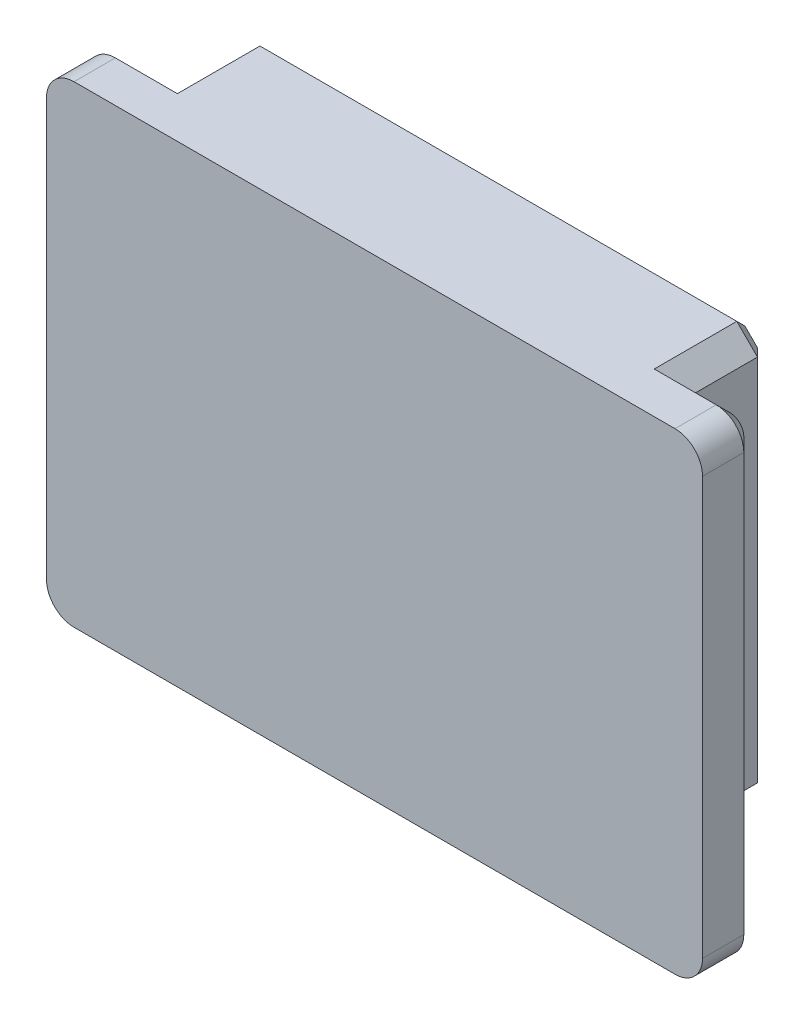
ISO-10303-21;
HEADER;
FILE_DESCRIPTION(('STEP AP214'),'2;1');
FILE_NAME('part.step','',(''),(''),'','','');
FILE_SCHEMA(('AUTOMOTIVE_DESIGN { 1 0 10303 214 1 1 1 1 }'));
ENDSEC;
DATA;
#1=APPLICATION_CONTEXT('core data for automotive mechanical design processes');
#2=APPLICATION_PROTOCOL_DEFINITION('international standard','automotive_design',2000,#1);
#3=PRODUCT_CONTEXT('',#1,'mechanical');
#4=PRODUCT('Part','Part','',(#3));
#5=PRODUCT_RELATED_PRODUCT_CATEGORY('part','',(#4));
#6=PRODUCT_DEFINITION_FORMATION('','',#4);
#7=PRODUCT_DEFINITION_CONTEXT('part definition',#1,'design');
#8=PRODUCT_DEFINITION('design','',#6,#7);
#9=PRODUCT_DEFINITION_SHAPE('','',#8);
#10=(LENGTH_UNIT() NAMED_UNIT(*) SI_UNIT(.MILLI.,.METRE.));
#11=(NAMED_UNIT(*) PLANE_ANGLE_UNIT() SI_UNIT($,.RADIAN.));
#12=(NAMED_UNIT(*) SI_UNIT($,.STERADIAN.) SOLID_ANGLE_UNIT());
#13=UNCERTAINTY_MEASURE_WITH_UNIT(LENGTH_MEASURE(1.E-05),#10,'distance_accuracy_value','');
#14=(GEOMETRIC_REPRESENTATION_CONTEXT(3) GLOBAL_UNCERTAINTY_ASSIGNED_CONTEXT((#13)) GLOBAL_UNIT_ASSIGNED_CONTEXT((#10,
#11,#12)) REPRESENTATION_CONTEXT('',''));
#15=CARTESIAN_POINT('',(0.,0.,0.));
#16=DIRECTION('',(0.,0.,1.));
#17=DIRECTION('',(1.,0.,0.));
#18=AXIS2_PLACEMENT_3D('',#15,#16,#17);
#19=CARTESIAN_POINT('',(0.,0.,0.));
#20=DIRECTION('',(0.,0.,1.));
#21=DIRECTION('',(1.,0.,0.));
#22=AXIS2_PLACEMENT_3D('',#19,#20,#21);
#23=PLANE('',#22);
#24=CARTESIAN_POINT('',(2.,32.3333333333333,0.));
#25=DIRECTION('',(0.,0.,1.));
#26=DIRECTION('',(1.,0.,0.));
#27=AXIS2_PLACEMENT_3D('',#24,#25,#26);
#28=CIRCLE('',#27,1.);
#29=CARTESIAN_POINT('',(1.,32.3333333333333,0.));
#30=VERTEX_POINT('',#29);
#31=CARTESIAN_POINT('',(2.,33.3333333333333,0.));
#32=VERTEX_POINT('',#31);
#33=EDGE_CURVE('E410',#30,#32,#28,.F.);
#34=ORIENTED_EDGE('',*,*,#33,.T.);
#35=DIRECTION('',(1.,0.,0.));
#36=VECTOR('',#35,1.);
#37=CARTESIAN_POINT('',(6.50757636642431,33.3333333333333,0.));
#38=LINE('',#37,#36);
#39=CARTESIAN_POINT('',(5.50757636642431,33.3333333333333,0.));
#40=VERTEX_POINT('',#39);
#41=EDGE_CURVE('E413',#32,#40,#38,.T.);
#42=ORIENTED_EDGE('',*,*,#41,.T.);
#43=DIRECTION('',(0.707106781186546,0.707106781186549,0.));
#44=VECTOR('',#43,1.);
#45=CARTESIAN_POINT('',(-13.9128784834545,13.9128784834544,0.));
#46=LINE('',#45,#44);
#47=CARTESIAN_POINT('',(5.00757636642431,32.8333333333333,0.));
#48=VERTEX_POINT('',#47);
#49=EDGE_CURVE('E295',#40,#48,#46,.F.);
#50=ORIENTED_EDGE('',*,*,#49,.T.);
#51=DIRECTION('',(0.,-1.,0.));
#52=VECTOR('',#51,1.);
#53=CARTESIAN_POINT('',(5.00757636642431,0.,0.));
#54=LINE('',#53,#52);
#55=CARTESIAN_POINT('',(5.00757636642431,6.03695282809008,0.));
#56=VERTEX_POINT('',#55);
#57=EDGE_CURVE('E510',#48,#56,#54,.T.);
#58=ORIENTED_EDGE('',*,*,#57,.T.);
#59=DIRECTION('',(-0.707106781186549,0.707106781186546,0.));
#60=VECTOR('',#59,1.);
#61=CARTESIAN_POINT('',(5.52226459725718,5.52226459725721,0.));
#62=LINE('',#61,#60);
#63=CARTESIAN_POINT('',(6.50757636642432,4.53695282809008,0.));
#64=VERTEX_POINT('',#63);
#65=EDGE_CURVE('E305',#56,#64,#62,.F.);
#66=ORIENTED_EDGE('',*,*,#65,.T.);
#67=DIRECTION('',(1.,0.,0.));
#68=VECTOR('',#67,1.);
#69=CARTESIAN_POINT('',(0.,4.53695282809008,0.));
#70=LINE('',#69,#68);
#71=CARTESIAN_POINT('',(41.1590903002424,4.53695282809008,0.));
#72=VERTEX_POINT('',#71);
#73=EDGE_CURVE('E506',#64,#72,#70,.T.);
#74=ORIENTED_EDGE('',*,*,#73,.T.);
#75=DIRECTION('',(0.707106781186544,0.707106781186551,0.));
#76=VECTOR('',#75,1.);
#77=CARTESIAN_POINT('',(18.3110687360763,-18.3110687360762,0.));
#78=LINE('',#77,#76);
#79=CARTESIAN_POINT('',(42.6590903002424,6.03695282809008,0.));
#80=VERTEX_POINT('',#79);
#81=EDGE_CURVE('E302',#72,#80,#78,.T.);
#82=ORIENTED_EDGE('',*,*,#81,.T.);
#83=DIRECTION('',(0.,-1.,0.));
#84=VECTOR('',#83,1.);
#85=CARTESIAN_POINT('',(42.6590903002424,0.,0.));
#86=LINE('',#85,#84);
#87=CARTESIAN_POINT('',(42.6590903002423,32.8333333333333,0.));
#88=VERTEX_POINT('',#87);
#89=EDGE_CURVE('E389',#88,#80,#86,.T.);
#90=ORIENTED_EDGE('',*,*,#89,.F.);
#91=DIRECTION('',(-0.707106781186549,0.707106781186546,0.));
#92=VECTOR('',#91,1.);
#93=CARTESIAN_POINT('',(37.7462118167877,37.7462118167879,0.));
#94=LINE('',#93,#92);
#95=CARTESIAN_POINT('',(42.1590903002423,33.3333333333333,0.));
#96=VERTEX_POINT('',#95);
#97=EDGE_CURVE('E298',#88,#96,#94,.T.);
#98=ORIENTED_EDGE('',*,*,#97,.T.);
#99=DIRECTION('',(1.,0.,0.));
#100=VECTOR('',#99,1.);
#101=CARTESIAN_POINT('',(45.6666666666667,33.3333333333333,0.));
#102=LINE('',#101,#100);
#103=CARTESIAN_POINT('',(45.6666666666667,33.3333333333333,0.));
#104=VERTEX_POINT('',#103);
#105=EDGE_CURVE('E358',#96,#104,#102,.T.);
#106=ORIENTED_EDGE('',*,*,#105,.T.);
#107=CARTESIAN_POINT('',(45.6666666666667,32.3333333333333,0.));
#108=DIRECTION('',(0.,0.,1.));
#109=DIRECTION('',(1.,0.,0.));
#110=AXIS2_PLACEMENT_3D('',#107,#108,#109);
#111=CIRCLE('',#110,1.);
#112=CARTESIAN_POINT('',(46.6666666666667,32.3333333333333,0.));
#113=VERTEX_POINT('',#112);
#114=EDGE_CURVE('E392',#104,#113,#111,.F.);
#115=ORIENTED_EDGE('',*,*,#114,.T.);
#116=DIRECTION('',(0.,-1.,0.));
#117=VECTOR('',#116,1.);
#118=CARTESIAN_POINT('',(46.6666666666667,0.,0.));
#119=LINE('',#118,#117);
#120=CARTESIAN_POINT('',(46.6666666666667,2.,0.));
#121=VERTEX_POINT('',#120);
#122=EDGE_CURVE('E395',#113,#121,#119,.T.);
#123=ORIENTED_EDGE('',*,*,#122,.T.);
#124=CARTESIAN_POINT('',(45.6666666666667,2.,0.));
#125=DIRECTION('',(0.,0.,1.));
#126=DIRECTION('',(1.,0.,0.));
#127=AXIS2_PLACEMENT_3D('',#124,#125,#126);
#128=CIRCLE('',#127,0.999999999999999);
#129=CARTESIAN_POINT('',(45.6666666666667,1.,0.));
#130=VERTEX_POINT('',#129);
#131=EDGE_CURVE('E398',#121,#130,#128,.F.);
#132=ORIENTED_EDGE('',*,*,#131,.T.);
#133=DIRECTION('',(-1.,0.,0.));
#134=VECTOR('',#133,1.);
#135=CARTESIAN_POINT('',(0.,1.,0.));
#136=LINE('',#135,#134);
#137=CARTESIAN_POINT('',(2.,1.,0.));
#138=VERTEX_POINT('',#137);
#139=EDGE_CURVE('E401',#130,#138,#136,.T.);
#140=ORIENTED_EDGE('',*,*,#139,.T.);
#141=CARTESIAN_POINT('',(2.,2.,0.));
#142=DIRECTION('',(0.,0.,1.));
#143=DIRECTION('',(1.,0.,0.));
#144=AXIS2_PLACEMENT_3D('',#141,#142,#143);
#145=CIRCLE('',#144,0.999999999999999);
#146=CARTESIAN_POINT('',(1.,2.,0.));
#147=VERTEX_POINT('',#146);
#148=EDGE_CURVE('E404',#138,#147,#145,.F.);
#149=ORIENTED_EDGE('',*,*,#148,.T.);
#150=DIRECTION('',(0.,1.,0.));
#151=VECTOR('',#150,1.);
#152=CARTESIAN_POINT('',(1.,32.3333333333333,0.));
#153=LINE('',#152,#151);
#154=EDGE_CURVE('E407',#147,#30,#153,.T.);
#155=ORIENTED_EDGE('',*,*,#154,.T.);
#156=EDGE_LOOP('',(#34,#42,#50,#58,#66,#74,#82,#90,#98,#106,#115,#123,#132,#140,#149,#155));
#157=FACE_BOUND('',#156,.T.);
#158=ADVANCED_FACE('F41',(#157),#23,.F.);
#159=CARTESIAN_POINT('',(0.,34.3333333333333,4.));
#160=DIRECTION('',(0.,1.,0.));
#161=DIRECTION('',(0.,0.,1.));
#162=AXIS2_PLACEMENT_3D('',#159,#160,#161);
#163=PLANE('',#162);
#164=DIRECTION('',(0.,0.,1.));
#165=VECTOR('',#164,1.);
#166=CARTESIAN_POINT('',(6.50757636642431,34.3333333333333,4.));
#167=LINE('',#166,#165);
#168=CARTESIAN_POINT('',(6.50757636642431,34.3333333333333,-5.));
#169=VERTEX_POINT('',#168);
#170=CARTESIAN_POINT('',(6.50757636642431,34.3333333333333,1.00000000000001));
#171=VERTEX_POINT('',#170);
#172=EDGE_CURVE('E271',#169,#171,#167,.T.);
#173=ORIENTED_EDGE('',*,*,#172,.T.);
#174=DIRECTION('',(-1.,0.,0.));
#175=VECTOR('',#174,1.);
#176=CARTESIAN_POINT('',(2.,34.3333333333333,1.00000000000001));
#177=LINE('',#176,#175);
#178=CARTESIAN_POINT('',(2.,34.3333333333333,1.00000000000001));
#179=VERTEX_POINT('',#178);
#180=EDGE_CURVE('E421',#171,#179,#177,.T.);
#181=ORIENTED_EDGE('',*,*,#180,.T.);
#182=DIRECTION('',(0.,0.,-1.));
#183=VECTOR('',#182,1.);
#184=CARTESIAN_POINT('',(2.,34.3333333333333,4.));
#185=LINE('',#184,#183);
#186=CARTESIAN_POINT('',(2.,34.3333333333333,4.));
#187=VERTEX_POINT('',#186);
#188=EDGE_CURVE('E250',#179,#187,#185,.F.);
#189=ORIENTED_EDGE('',*,*,#188,.T.);
#190=DIRECTION('',(1.,0.,0.));
#191=VECTOR('',#190,1.);
#192=CARTESIAN_POINT('',(0.,34.3333333333333,4.));
#193=LINE('',#192,#191);
#194=CARTESIAN_POINT('',(45.6666666666667,34.3333333333333,4.));
#195=VERTEX_POINT('',#194);
#196=EDGE_CURVE('E237',#187,#195,#193,.T.);
#197=ORIENTED_EDGE('',*,*,#196,.T.);
#198=DIRECTION('',(0.,0.,-1.));
#199=VECTOR('',#198,1.);
#200=CARTESIAN_POINT('',(45.6666666666667,34.3333333333333,0.));
#201=LINE('',#200,#199);
#202=CARTESIAN_POINT('',(45.6666666666667,34.3333333333333,1.00000000000001));
#203=VERTEX_POINT('',#202);
#204=EDGE_CURVE('E490',#195,#203,#201,.T.);
#205=ORIENTED_EDGE('',*,*,#204,.T.);
#206=DIRECTION('',(-1.,0.,0.));
#207=VECTOR('',#206,1.);
#208=CARTESIAN_POINT('',(41.1590903002423,34.3333333333333,1.00000000000001));
#209=LINE('',#208,#207);
#210=CARTESIAN_POINT('',(41.1590903002423,34.3333333333333,1.00000000000001));
#211=VERTEX_POINT('',#210);
#212=EDGE_CURVE('E417',#203,#211,#209,.T.);
#213=ORIENTED_EDGE('',*,*,#212,.T.);
#214=DIRECTION('',(0.,0.,-1.));
#215=VECTOR('',#214,1.);
#216=CARTESIAN_POINT('',(41.1590903002423,34.3333333333333,-6.));
#217=LINE('',#216,#215);
#218=CARTESIAN_POINT('',(41.1590903002423,34.3333333333333,-5.));
#219=VERTEX_POINT('',#218);
#220=EDGE_CURVE('E267',#211,#219,#217,.T.);
#221=ORIENTED_EDGE('',*,*,#220,.T.);
#222=DIRECTION('',(-1.,0.,0.));
#223=VECTOR('',#222,1.);
#224=CARTESIAN_POINT('',(6.50757636642431,34.3333333333333,-5.));
#225=LINE('',#224,#223);
#226=EDGE_CURVE('E337',#219,#169,#225,.T.);
#227=ORIENTED_EDGE('',*,*,#226,.T.);
#228=EDGE_LOOP('',(#173,#181,#189,#197,#205,#213,#221,#227));
#229=FACE_BOUND('',#228,.T.);
#230=ADVANCED_FACE('F487',(#229),#163,.T.);
#231=CARTESIAN_POINT('',(0.,0.,4.));
#232=DIRECTION('',(-1.,0.,0.));
#233=DIRECTION('',(0.,0.,1.));
#234=AXIS2_PLACEMENT_3D('',#231,#232,#233);
#235=PLANE('',#234);
#236=DIRECTION('',(0.,0.,-1.));
#237=VECTOR('',#236,1.);
#238=CARTESIAN_POINT('',(0.,32.3333333333333,4.));
#239=LINE('',#238,#237);
#240=CARTESIAN_POINT('',(0.,32.3333333333333,4.));
#241=VERTEX_POINT('',#240);
#242=CARTESIAN_POINT('',(0.,32.3333333333333,1.00000000000001));
#243=VERTEX_POINT('',#242);
#244=EDGE_CURVE('E224',#241,#243,#239,.T.);
#245=ORIENTED_EDGE('',*,*,#244,.T.);
#246=DIRECTION('',(0.,-1.,0.));
#247=VECTOR('',#246,1.);
#248=CARTESIAN_POINT('',(0.,2.,1.00000000000001));
#249=LINE('',#248,#247);
#250=CARTESIAN_POINT('',(0.,2.,1.00000000000001));
#251=VERTEX_POINT('',#250);
#252=EDGE_CURVE('E219',#243,#251,#249,.T.);
#253=ORIENTED_EDGE('',*,*,#252,.T.);
#254=DIRECTION('',(0.,0.,-1.));
#255=VECTOR('',#254,1.);
#256=CARTESIAN_POINT('',(0.,2.,4.));
#257=LINE('',#256,#255);
#258=CARTESIAN_POINT('',(0.,2.,4.));
#259=VERTEX_POINT('',#258);
#260=EDGE_CURVE('E212',#251,#259,#257,.F.);
#261=ORIENTED_EDGE('',*,*,#260,.T.);
#262=DIRECTION('',(0.,1.,0.));
#263=VECTOR('',#262,1.);
#264=CARTESIAN_POINT('',(0.,0.,4.));
#265=LINE('',#264,#263);
#266=EDGE_CURVE('E216',#259,#241,#265,.T.);
#267=ORIENTED_EDGE('',*,*,#266,.T.);
#268=EDGE_LOOP('',(#245,#253,#261,#267));
#269=FACE_BOUND('',#268,.T.);
#270=ADVANCED_FACE('F215',(#269),#235,.T.);
#271=CARTESIAN_POINT('',(0.,0.,4.));
#272=DIRECTION('',(0.,1.,0.));
#273=DIRECTION('',(0.,0.,1.));
#274=AXIS2_PLACEMENT_3D('',#271,#272,#273);
#275=PLANE('',#274);
#276=DIRECTION('',(0.,0.,-1.));
#277=VECTOR('',#276,1.);
#278=CARTESIAN_POINT('',(2.,0.,0.));
#279=LINE('',#278,#277);
#280=CARTESIAN_POINT('',(2.,0.,4.));
#281=VERTEX_POINT('',#280);
#282=CARTESIAN_POINT('',(2.,0.,1.00000000000001));
#283=VERTEX_POINT('',#282);
#284=EDGE_CURVE('E242',#281,#283,#279,.T.);
#285=ORIENTED_EDGE('',*,*,#284,.T.);
#286=DIRECTION('',(1.,0.,0.));
#287=VECTOR('',#286,1.);
#288=CARTESIAN_POINT('',(0.,0.,1.00000000000001));
#289=LINE('',#288,#287);
#290=CARTESIAN_POINT('',(45.6666666666667,0.,1.00000000000001));
#291=VERTEX_POINT('',#290);
#292=EDGE_CURVE('E432',#283,#291,#289,.T.);
#293=ORIENTED_EDGE('',*,*,#292,.T.);
#294=DIRECTION('',(0.,0.,-1.));
#295=VECTOR('',#294,1.);
#296=CARTESIAN_POINT('',(45.6666666666667,0.,4.));
#297=LINE('',#296,#295);
#298=CARTESIAN_POINT('',(45.6666666666667,0.,4.));
#299=VERTEX_POINT('',#298);
#300=EDGE_CURVE('E262',#291,#299,#297,.F.);
#301=ORIENTED_EDGE('',*,*,#300,.T.);
#302=DIRECTION('',(1.,0.,0.));
#303=VECTOR('',#302,1.);
#304=CARTESIAN_POINT('',(0.,0.,4.));
#305=LINE('',#304,#303);
#306=EDGE_CURVE('E236',#281,#299,#305,.T.);
#307=ORIENTED_EDGE('',*,*,#306,.F.);
#308=EDGE_LOOP('',(#285,#293,#301,#307));
#309=FACE_BOUND('',#308,.T.);
#310=ADVANCED_FACE('F608',(#309),#275,.F.);
#311=CARTESIAN_POINT('',(47.6666666666667,0.,4.));
#312=DIRECTION('',(-1.,0.,0.));
#313=DIRECTION('',(0.,0.,1.));
#314=AXIS2_PLACEMENT_3D('',#311,#312,#313);
#315=PLANE('',#314);
#316=DIRECTION('',(0.,0.,-1.));
#317=VECTOR('',#316,1.);
#318=CARTESIAN_POINT('',(47.6666666666667,2.,4.));
#319=LINE('',#318,#317);
#320=CARTESIAN_POINT('',(47.6666666666667,2.,4.));
#321=VERTEX_POINT('',#320);
#322=CARTESIAN_POINT('',(47.6666666666667,2.,1.00000000000001));
#323=VERTEX_POINT('',#322);
#324=EDGE_CURVE('E256',#321,#323,#319,.T.);
#325=ORIENTED_EDGE('',*,*,#324,.T.);
#326=DIRECTION('',(0.,1.,0.));
#327=VECTOR('',#326,1.);
#328=CARTESIAN_POINT('',(47.6666666666667,0.,1.00000000000001));
#329=LINE('',#328,#327);
#330=CARTESIAN_POINT('',(47.6666666666667,32.3333333333333,1.00000000000001));
#331=VERTEX_POINT('',#330);
#332=EDGE_CURVE('E59',#323,#331,#329,.T.);
#333=ORIENTED_EDGE('',*,*,#332,.T.);
#334=DIRECTION('',(0.,0.,-1.));
#335=VECTOR('',#334,1.);
#336=CARTESIAN_POINT('',(47.6666666666667,32.3333333333333,4.));
#337=LINE('',#336,#335);
#338=CARTESIAN_POINT('',(47.6666666666667,32.3333333333333,4.));
#339=VERTEX_POINT('',#338);
#340=EDGE_CURVE('E259',#331,#339,#337,.F.);
#341=ORIENTED_EDGE('',*,*,#340,.T.);
#342=DIRECTION('',(0.,1.,0.));
#343=VECTOR('',#342,1.);
#344=CARTESIAN_POINT('',(47.6666666666667,0.,4.));
#345=LINE('',#344,#343);
#346=EDGE_CURVE('E225',#321,#339,#345,.T.);
#347=ORIENTED_EDGE('',*,*,#346,.F.);
#348=EDGE_LOOP('',(#325,#333,#341,#347));
#349=FACE_BOUND('',#348,.T.);
#350=ADVANCED_FACE('F634',(#349),#315,.F.);
#351=CARTESIAN_POINT('',(0.,0.,4.));
#352=DIRECTION('',(0.,0.,1.));
#353=DIRECTION('',(1.,0.,0.));
#354=AXIS2_PLACEMENT_3D('',#351,#352,#353);
#355=PLANE('',#354);
#356=ORIENTED_EDGE('',*,*,#196,.F.);
#357=CARTESIAN_POINT('',(2.,32.3333333333333,4.));
#358=DIRECTION('',(0.,0.,1.));
#359=DIRECTION('',(1.,0.,0.));
#360=AXIS2_PLACEMENT_3D('',#357,#358,#359);
#361=CIRCLE('',#360,2.);
#362=EDGE_CURVE('E234',#187,#241,#361,.T.);
#363=ORIENTED_EDGE('',*,*,#362,.T.);
#364=ORIENTED_EDGE('',*,*,#266,.F.);
#365=CARTESIAN_POINT('',(2.,2.,4.));
#366=DIRECTION('',(0.,0.,1.));
#367=DIRECTION('',(1.,0.,0.));
#368=AXIS2_PLACEMENT_3D('',#365,#366,#367);
#369=CIRCLE('',#368,2.);
#370=EDGE_CURVE('E231',#259,#281,#369,.T.);
#371=ORIENTED_EDGE('',*,*,#370,.T.);
#372=ORIENTED_EDGE('',*,*,#306,.T.);
#373=CARTESIAN_POINT('',(45.6666666666667,2.,4.));
#374=DIRECTION('',(0.,0.,1.));
#375=DIRECTION('',(1.,0.,0.));
#376=AXIS2_PLACEMENT_3D('',#373,#374,#375);
#377=CIRCLE('',#376,2.);
#378=EDGE_CURVE('E245',#299,#321,#377,.T.);
#379=ORIENTED_EDGE('',*,*,#378,.T.);
#380=ORIENTED_EDGE('',*,*,#346,.T.);
#381=CARTESIAN_POINT('',(45.6666666666667,32.3333333333333,4.));
#382=DIRECTION('',(0.,0.,1.));
#383=DIRECTION('',(1.,0.,0.));
#384=AXIS2_PLACEMENT_3D('',#381,#382,#383);
#385=CIRCLE('',#384,2.);
#386=EDGE_CURVE('E244',#339,#195,#385,.T.);
#387=ORIENTED_EDGE('',*,*,#386,.T.);
#388=EDGE_LOOP('',(#356,#363,#364,#371,#372,#379,#380,#387));
#389=FACE_BOUND('',#388,.T.);
#390=ADVANCED_FACE('F229',(#389),#355,.T.);
#391=CARTESIAN_POINT('',(42.6590903002424,0.,-6.));
#392=DIRECTION('',(-1.,0.,0.));
#393=DIRECTION('',(0.,-1.,0.));
#394=AXIS2_PLACEMENT_3D('',#391,#392,#393);
#395=PLANE('',#394);
#396=DIRECTION('',(0.,0.,-1.));
#397=VECTOR('',#396,1.);
#398=CARTESIAN_POINT('',(42.6590903002424,6.03695282809008,-6.));
#399=LINE('',#398,#397);
#400=CARTESIAN_POINT('',(42.6590903002424,6.03695282809008,-5.));
#401=VERTEX_POINT('',#400);
#402=EDGE_CURVE('E281',#80,#401,#399,.T.);
#403=ORIENTED_EDGE('',*,*,#402,.T.);
#404=DIRECTION('',(0.,1.,0.));
#405=VECTOR('',#404,1.);
#406=CARTESIAN_POINT('',(42.6590903002424,0.,-5.));
#407=LINE('',#406,#405);
#408=CARTESIAN_POINT('',(42.6590903002423,32.8333333333333,-5.));
#409=VERTEX_POINT('',#408);
#410=EDGE_CURVE('E349',#401,#409,#407,.T.);
#411=ORIENTED_EDGE('',*,*,#410,.T.);
#412=DIRECTION('',(0.,0.,1.));
#413=VECTOR('',#412,1.);
#414=CARTESIAN_POINT('',(42.6590903002423,32.8333333333333,0.));
#415=LINE('',#414,#413);
#416=EDGE_CURVE('E285',#409,#88,#415,.T.);
#417=ORIENTED_EDGE('',*,*,#416,.T.);
#418=ORIENTED_EDGE('',*,*,#89,.T.);
#419=EDGE_LOOP('',(#403,#411,#417,#418));
#420=FACE_BOUND('',#419,.T.);
#421=ADVANCED_FACE('F519',(#420),#395,.F.);
#422=CARTESIAN_POINT('',(0.,4.53695282809008,-6.));
#423=DIRECTION('',(0.,-1.,0.));
#424=DIRECTION('',(0.,0.,-1.));
#425=AXIS2_PLACEMENT_3D('',#422,#423,#424);
#426=PLANE('',#425);
#427=DIRECTION('',(0.,0.,-1.));
#428=VECTOR('',#427,1.);
#429=CARTESIAN_POINT('',(6.50757636642432,4.53695282809008,-6.));
#430=LINE('',#429,#428);
#431=CARTESIAN_POINT('',(6.50757636642432,4.53695282809008,-5.));
#432=VERTEX_POINT('',#431);
#433=EDGE_CURVE('E288',#64,#432,#430,.T.);
#434=ORIENTED_EDGE('',*,*,#433,.T.);
#435=DIRECTION('',(1.,0.,0.));
#436=VECTOR('',#435,1.);
#437=CARTESIAN_POINT('',(41.1590903002424,4.53695282809008,-5.));
#438=LINE('',#437,#436);
#439=CARTESIAN_POINT('',(41.1590903002424,4.53695282809008,-5.));
#440=VERTEX_POINT('',#439);
#441=EDGE_CURVE('E355',#432,#440,#438,.T.);
#442=ORIENTED_EDGE('',*,*,#441,.T.);
#443=DIRECTION('',(0.,0.,1.));
#444=VECTOR('',#443,1.);
#445=CARTESIAN_POINT('',(41.1590903002424,4.53695282809008,0.));
#446=LINE('',#445,#444);
#447=EDGE_CURVE('E292',#440,#72,#446,.T.);
#448=ORIENTED_EDGE('',*,*,#447,.T.);
#449=ORIENTED_EDGE('',*,*,#73,.F.);
#450=EDGE_LOOP('',(#434,#442,#448,#449));
#451=FACE_BOUND('',#450,.T.);
#452=ADVANCED_FACE('F584',(#451),#426,.T.);
#453=CARTESIAN_POINT('',(5.00757636642431,0.,-6.));
#454=DIRECTION('',(-1.,0.,0.));
#455=DIRECTION('',(0.,0.,1.));
#456=AXIS2_PLACEMENT_3D('',#453,#454,#455);
#457=PLANE('',#456);
#458=DIRECTION('',(0.,0.,-1.));
#459=VECTOR('',#458,1.);
#460=CARTESIAN_POINT('',(5.00757636642431,32.8333333333333,-6.));
#461=LINE('',#460,#459);
#462=CARTESIAN_POINT('',(5.00757636642431,32.8333333333333,-5.));
#463=VERTEX_POINT('',#462);
#464=EDGE_CURVE('E277',#48,#463,#461,.T.);
#465=ORIENTED_EDGE('',*,*,#464,.T.);
#466=DIRECTION('',(0.,-1.,0.));
#467=VECTOR('',#466,1.);
#468=CARTESIAN_POINT('',(5.00757636642431,6.03695282809008,-5.));
#469=LINE('',#468,#467);
#470=CARTESIAN_POINT('',(5.00757636642431,6.03695282809008,-5.));
#471=VERTEX_POINT('',#470);
#472=EDGE_CURVE('E343',#463,#471,#469,.T.);
#473=ORIENTED_EDGE('',*,*,#472,.T.);
#474=DIRECTION('',(0.,0.,1.));
#475=VECTOR('',#474,1.);
#476=CARTESIAN_POINT('',(5.00757636642431,6.03695282809008,-6.));
#477=LINE('',#476,#475);
#478=EDGE_CURVE('E274',#471,#56,#477,.T.);
#479=ORIENTED_EDGE('',*,*,#478,.T.);
#480=ORIENTED_EDGE('',*,*,#57,.F.);
#481=EDGE_LOOP('',(#465,#473,#479,#480));
#482=FACE_BOUND('',#481,.T.);
#483=ADVANCED_FACE('F568',(#482),#457,.T.);
#484=CARTESIAN_POINT('',(0.,0.,-6.));
#485=DIRECTION('',(0.,0.,1.));
#486=DIRECTION('',(1.,0.,0.));
#487=AXIS2_PLACEMENT_3D('',#484,#485,#486);
#488=PLANE('',#487);
#489=DIRECTION('',(1.,0.,0.));
#490=VECTOR('',#489,1.);
#491=CARTESIAN_POINT('',(41.1590903002423,33.3333333333333,-6.));
#492=LINE('',#491,#490);
#493=CARTESIAN_POINT('',(6.9217899287974,33.3333333333333,-6.));
#494=VERTEX_POINT('',#493);
#495=CARTESIAN_POINT('',(40.7448767378692,33.3333333333333,-6.));
#496=VERTEX_POINT('',#495);
#497=EDGE_CURVE('E326',#494,#496,#492,.T.);
#498=ORIENTED_EDGE('',*,*,#497,.T.);
#499=DIRECTION('',(0.707106781186549,-0.707106781186546,0.));
#500=VECTOR('',#499,1.);
#501=CARTESIAN_POINT('',(41.9519835190558,32.1262265521468,-6.));
#502=LINE('',#501,#500);
#503=CARTESIAN_POINT('',(41.6590903002423,32.4191197709602,-6.));
#504=VERTEX_POINT('',#503);
#505=EDGE_CURVE('E329',#496,#504,#502,.T.);
#506=ORIENTED_EDGE('',*,*,#505,.T.);
#507=DIRECTION('',(0.,-1.,0.));
#508=VECTOR('',#507,1.);
#509=CARTESIAN_POINT('',(41.6590903002424,0.,-6.));
#510=LINE('',#509,#508);
#511=CARTESIAN_POINT('',(41.6590903002424,6.45116639046318,-6.));
#512=VERTEX_POINT('',#511);
#513=EDGE_CURVE('E314',#504,#512,#510,.T.);
#514=ORIENTED_EDGE('',*,*,#513,.T.);
#515=DIRECTION('',(-0.707106781186544,-0.707106781186551,0.));
#516=VECTOR('',#515,1.);
#517=CARTESIAN_POINT('',(40.4519835190558,5.24405960927663,-6.));
#518=LINE('',#517,#516);
#519=CARTESIAN_POINT('',(40.7448767378693,5.53695282809008,-6.));
#520=VERTEX_POINT('',#519);
#521=EDGE_CURVE('E311',#512,#520,#518,.T.);
#522=ORIENTED_EDGE('',*,*,#521,.T.);
#523=DIRECTION('',(-1.,0.,0.));
#524=VECTOR('',#523,1.);
#525=CARTESIAN_POINT('',(6.50757636642432,5.53695282809008,-6.));
#526=LINE('',#525,#524);
#527=CARTESIAN_POINT('',(6.92178992879741,5.53695282809008,-6.));
#528=VERTEX_POINT('',#527);
#529=EDGE_CURVE('E308',#520,#528,#526,.T.);
#530=ORIENTED_EDGE('',*,*,#529,.T.);
#531=DIRECTION('',(-0.707106781186549,0.707106781186546,0.));
#532=VECTOR('',#531,1.);
#533=CARTESIAN_POINT('',(5.71468314761085,6.74405960927663,-6.));
#534=LINE('',#533,#532);
#535=CARTESIAN_POINT('',(6.00757636642431,6.45116639046318,-6.));
#536=VERTEX_POINT('',#535);
#537=EDGE_CURVE('E317',#528,#536,#534,.T.);
#538=ORIENTED_EDGE('',*,*,#537,.T.);
#539=DIRECTION('',(0.,1.,0.));
#540=VECTOR('',#539,1.);
#541=CARTESIAN_POINT('',(6.00757636642431,32.8333333333333,-6.));
#542=LINE('',#541,#540);
#543=CARTESIAN_POINT('',(6.00757636642431,32.4191197709602,-6.));
#544=VERTEX_POINT('',#543);
#545=EDGE_CURVE('E320',#536,#544,#542,.T.);
#546=ORIENTED_EDGE('',*,*,#545,.T.);
#547=DIRECTION('',(0.707106781186546,0.707106781186549,0.));
#548=VECTOR('',#547,1.);
#549=CARTESIAN_POINT('',(7.21468314761086,33.6262265521468,-6.));
#550=LINE('',#549,#548);
#551=EDGE_CURVE('E323',#544,#494,#550,.T.);
#552=ORIENTED_EDGE('',*,*,#551,.T.);
#553=EDGE_LOOP('',(#498,#506,#514,#522,#530,#538,#546,#552));
#554=FACE_BOUND('',#553,.T.);
#555=ADVANCED_FACE('F644',(#554),#488,.F.);
#556=CARTESIAN_POINT('',(2.,32.3333333333333,4.));
#557=DIRECTION('',(0.,0.,-1.));
#558=DIRECTION('',(-1.,0.,0.));
#559=AXIS2_PLACEMENT_3D('',#556,#557,#558);
#560=CYLINDRICAL_SURFACE('',#559,2.);
#561=ORIENTED_EDGE('',*,*,#188,.F.);
#562=CARTESIAN_POINT('',(2.,32.3333333333333,1.00000000000001));
#563=DIRECTION('',(0.,0.,1.));
#564=DIRECTION('',(1.,0.,0.));
#565=AXIS2_PLACEMENT_3D('',#562,#563,#564);
#566=CIRCLE('',#565,2.);
#567=EDGE_CURVE('E424',#179,#243,#566,.T.);
#568=ORIENTED_EDGE('',*,*,#567,.T.);
#569=ORIENTED_EDGE('',*,*,#244,.F.);
#570=ORIENTED_EDGE('',*,*,#362,.F.);
#571=EDGE_LOOP('',(#561,#568,#569,#570));
#572=FACE_BOUND('',#571,.T.);
#573=ADVANCED_FACE('F594',(#572),#560,.T.);
#574=CARTESIAN_POINT('',(45.6666666666667,32.3333333333333,4.));
#575=DIRECTION('',(0.,0.,1.));
#576=DIRECTION('',(1.,0.,0.));
#577=AXIS2_PLACEMENT_3D('',#574,#575,#576);
#578=CYLINDRICAL_SURFACE('',#577,2.);
#579=ORIENTED_EDGE('',*,*,#340,.F.);
#580=CARTESIAN_POINT('',(45.6666666666667,32.3333333333333,1.00000000000001));
#581=DIRECTION('',(0.,0.,1.));
#582=DIRECTION('',(1.,0.,0.));
#583=AXIS2_PLACEMENT_3D('',#580,#581,#582);
#584=CIRCLE('',#583,2.);
#585=EDGE_CURVE('E439',#331,#203,#584,.T.);
#586=ORIENTED_EDGE('',*,*,#585,.T.);
#587=ORIENTED_EDGE('',*,*,#204,.F.);
#588=ORIENTED_EDGE('',*,*,#386,.F.);
#589=EDGE_LOOP('',(#579,#586,#587,#588));
#590=FACE_BOUND('',#589,.T.);
#591=ADVANCED_FACE('F643',(#590),#578,.T.);
#592=CARTESIAN_POINT('',(2.,2.,4.));
#593=DIRECTION('',(0.,0.,1.));
#594=DIRECTION('',(1.,0.,0.));
#595=AXIS2_PLACEMENT_3D('',#592,#593,#594);
#596=CYLINDRICAL_SURFACE('',#595,2.);
#597=ORIENTED_EDGE('',*,*,#260,.F.);
#598=CARTESIAN_POINT('',(2.,2.,1.00000000000001));
#599=DIRECTION('',(0.,0.,1.));
#600=DIRECTION('',(1.,0.,0.));
#601=AXIS2_PLACEMENT_3D('',#598,#599,#600);
#602=CIRCLE('',#601,2.);
#603=EDGE_CURVE('E429',#251,#283,#602,.T.);
#604=ORIENTED_EDGE('',*,*,#603,.T.);
#605=ORIENTED_EDGE('',*,*,#284,.F.);
#606=ORIENTED_EDGE('',*,*,#370,.F.);
#607=EDGE_LOOP('',(#597,#604,#605,#606));
#608=FACE_BOUND('',#607,.T.);
#609=ADVANCED_FACE('F240',(#608),#596,.T.);
#610=CARTESIAN_POINT('',(45.6666666666667,2.,4.));
#611=DIRECTION('',(0.,0.,-1.));
#612=DIRECTION('',(-1.,0.,0.));
#613=AXIS2_PLACEMENT_3D('',#610,#611,#612);
#614=CYLINDRICAL_SURFACE('',#613,2.);
#615=ORIENTED_EDGE('',*,*,#300,.F.);
#616=CARTESIAN_POINT('',(45.6666666666667,2.,1.00000000000001));
#617=DIRECTION('',(0.,0.,1.));
#618=DIRECTION('',(1.,0.,0.));
#619=AXIS2_PLACEMENT_3D('',#616,#617,#618);
#620=CIRCLE('',#619,2.);
#621=EDGE_CURVE('E67',#291,#323,#620,.T.);
#622=ORIENTED_EDGE('',*,*,#621,.T.);
#623=ORIENTED_EDGE('',*,*,#324,.F.);
#624=ORIENTED_EDGE('',*,*,#378,.F.);
#625=EDGE_LOOP('',(#615,#622,#623,#624));
#626=FACE_BOUND('',#625,.T.);
#627=ADVANCED_FACE('F649',(#626),#614,.T.);
#628=CARTESIAN_POINT('',(6.50757636642431,34.3333333333333,4.));
#629=DIRECTION('',(0.707106781186549,-0.707106781186546,0.));
#630=DIRECTION('',(0.,0.,1.));
#631=AXIS2_PLACEMENT_3D('',#628,#629,#630);
#632=PLANE('',#631);
#633=ORIENTED_EDGE('',*,*,#172,.F.);
#634=DIRECTION('',(0.707106781186546,0.707106781186549,0.));
#635=VECTOR('',#634,1.);
#636=CARTESIAN_POINT('',(5.00757636642431,32.8333333333333,-5.));
#637=LINE('',#636,#635);
#638=EDGE_CURVE('E340',#169,#463,#637,.F.);
#639=ORIENTED_EDGE('',*,*,#638,.T.);
#640=ORIENTED_EDGE('',*,*,#464,.F.);
#641=ORIENTED_EDGE('',*,*,#49,.F.);
#642=DIRECTION('',(-0.577350269189623,-0.577350269189625,-0.577350269189629));
#643=VECTOR('',#642,1.);
#644=CARTESIAN_POINT('',(3.67171757761623,31.4974745445252,-1.83585878880811));
#645=LINE('',#644,#643);
#646=EDGE_CURVE('E51',#40,#171,#645,.F.);
#647=ORIENTED_EDGE('',*,*,#646,.T.);
#648=EDGE_LOOP('',(#633,#639,#640,#641,#647));
#649=FACE_BOUND('',#648,.T.);
#650=ADVANCED_FACE('F553',(#649),#632,.F.);
#651=CARTESIAN_POINT('',(42.6590903002423,32.8333333333333,-6.));
#652=DIRECTION('',(0.707106781186546,0.707106781186549,0.));
#653=DIRECTION('',(0.,0.,-1.));
#654=AXIS2_PLACEMENT_3D('',#651,#652,#653);
#655=PLANE('',#654);
#656=ORIENTED_EDGE('',*,*,#416,.F.);
#657=DIRECTION('',(-0.707106781186549,0.707106781186546,0.));
#658=VECTOR('',#657,1.);
#659=CARTESIAN_POINT('',(41.1590903002423,34.3333333333333,-5.));
#660=LINE('',#659,#658);
#661=EDGE_CURVE('E333',#409,#219,#660,.T.);
#662=ORIENTED_EDGE('',*,*,#661,.T.);
#663=ORIENTED_EDGE('',*,*,#220,.F.);
#664=DIRECTION('',(0.577350269189626,-0.577350269189624,-0.577350269189628));
#665=VECTOR('',#664,1.);
#666=CARTESIAN_POINT('',(28.1060602001615,47.3863634334141,14.0530301000808));
#667=LINE('',#666,#665);
#668=EDGE_CURVE('E11',#211,#96,#667,.T.);
#669=ORIENTED_EDGE('',*,*,#668,.T.);
#670=ORIENTED_EDGE('',*,*,#97,.F.);
#671=EDGE_LOOP('',(#656,#662,#663,#669,#670));
#672=FACE_BOUND('',#671,.T.);
#673=ADVANCED_FACE('F540',(#672),#655,.T.);
#674=CARTESIAN_POINT('',(41.1590903002424,4.53695282809008,-6.));
#675=DIRECTION('',(0.707106781186551,-0.707106781186544,0.));
#676=DIRECTION('',(0.,0.,-1.));
#677=AXIS2_PLACEMENT_3D('',#674,#675,#676);
#678=PLANE('',#677);
#679=ORIENTED_EDGE('',*,*,#447,.F.);
#680=DIRECTION('',(0.707106781186544,0.707106781186551,0.));
#681=VECTOR('',#680,1.);
#682=CARTESIAN_POINT('',(42.6590903002424,6.03695282809008,-5.));
#683=LINE('',#682,#681);
#684=EDGE_CURVE('E352',#440,#401,#683,.T.);
#685=ORIENTED_EDGE('',*,*,#684,.T.);
#686=ORIENTED_EDGE('',*,*,#402,.F.);
#687=ORIENTED_EDGE('',*,*,#81,.F.);
#688=EDGE_LOOP('',(#679,#685,#686,#687));
#689=FACE_BOUND('',#688,.T.);
#690=ADVANCED_FACE('F527',(#689),#678,.T.);
#691=CARTESIAN_POINT('',(5.00757636642431,6.03695282809008,-6.));
#692=DIRECTION('',(0.707106781186546,0.707106781186549,0.));
#693=DIRECTION('',(0.,0.,1.));
#694=AXIS2_PLACEMENT_3D('',#691,#692,#693);
#695=PLANE('',#694);
#696=ORIENTED_EDGE('',*,*,#478,.F.);
#697=DIRECTION('',(-0.707106781186549,0.707106781186546,0.));
#698=VECTOR('',#697,1.);
#699=CARTESIAN_POINT('',(6.50757636642432,4.53695282809008,-5.));
#700=LINE('',#699,#698);
#701=EDGE_CURVE('E346',#471,#432,#700,.F.);
#702=ORIENTED_EDGE('',*,*,#701,.T.);
#703=ORIENTED_EDGE('',*,*,#433,.F.);
#704=ORIENTED_EDGE('',*,*,#65,.F.);
#705=EDGE_LOOP('',(#696,#702,#703,#704));
#706=FACE_BOUND('',#705,.T.);
#707=ADVANCED_FACE('F573',(#706),#695,.F.);
#708=CARTESIAN_POINT('',(6.22937137844373,6.22937137844376,-6.));
#709=DIRECTION('',(0.499999999999999,0.500000000000001,0.707106781186547));
#710=DIRECTION('',(-0.707106781186549,0.707106781186546,0.));
#711=AXIS2_PLACEMENT_3D('',#708,#709,#710);
#712=PLANE('',#711);
#713=DIRECTION('',(-0.281084637714819,-0.678598344545847,0.678598344545847));
#714=VECTOR('',#713,1.);
#715=CARTESIAN_POINT('',(5.99342204038511,3.29567448101342,-3.75872165292334));
#716=LINE('',#715,#714);
#717=EDGE_CURVE('E381',#432,#528,#716,.F.);
#718=ORIENTED_EDGE('',*,*,#717,.F.);
#719=ORIENTED_EDGE('',*,*,#701,.F.);
#720=DIRECTION('',(-0.678598344545847,-0.28108463771482,0.678598344545847));
#721=VECTOR('',#720,1.);
#722=CARTESIAN_POINT('',(6.06740604630972,6.47594865530415,-6.05982967988541));
#723=LINE('',#722,#721);
#724=EDGE_CURVE('E385',#536,#471,#723,.T.);
#725=ORIENTED_EDGE('',*,*,#724,.F.);
#726=ORIENTED_EDGE('',*,*,#537,.F.);
#727=EDGE_LOOP('',(#718,#719,#725,#726));
#728=FACE_BOUND('',#727,.T.);
#729=ADVANCED_FACE('F577',(#728),#712,.F.);
#730=CARTESIAN_POINT('',(5.00757636642431,0.,-5.));
#731=DIRECTION('',(-0.707106781186547,0.,-0.707106781186547));
#732=DIRECTION('',(0.,1.,0.));
#733=AXIS2_PLACEMENT_3D('',#730,#731,#732);
#734=PLANE('',#733);
#735=ORIENTED_EDGE('',*,*,#724,.T.);
#736=ORIENTED_EDGE('',*,*,#472,.F.);
#737=DIRECTION('',(-0.678598344545848,0.281084637714818,0.678598344545848));
#738=VECTOR('',#737,1.);
#739=CARTESIAN_POINT('',(11.2703235758605,30.2392185014706,-11.2627472094362));
#740=LINE('',#739,#738);
#741=EDGE_CURVE('E377',#544,#463,#740,.T.);
#742=ORIENTED_EDGE('',*,*,#741,.F.);
#743=ORIENTED_EDGE('',*,*,#545,.F.);
#744=EDGE_LOOP('',(#735,#736,#742,#743));
#745=FACE_BOUND('',#744,.T.);
#746=ADVANCED_FACE('F564',(#745),#734,.T.);
#747=CARTESIAN_POINT('',(0.,4.53695282809008,-5.));
#748=DIRECTION('',(0.,-0.707106781186547,-0.707106781186547));
#749=DIRECTION('',(-1.,0.,0.));
#750=AXIS2_PLACEMENT_3D('',#747,#748,#749);
#751=PLANE('',#750);
#752=ORIENTED_EDGE('',*,*,#717,.T.);
#753=ORIENTED_EDGE('',*,*,#529,.F.);
#754=DIRECTION('',(0.281084637714822,-0.678598344545847,0.678598344545847));
#755=VECTOR('',#754,1.);
#756=CARTESIAN_POINT('',(37.9071692866229,12.3877846429362,-12.8508318148461));
#757=LINE('',#756,#755);
#758=EDGE_CURVE('E373',#440,#520,#757,.F.);
#759=ORIENTED_EDGE('',*,*,#758,.F.);
#760=ORIENTED_EDGE('',*,*,#441,.F.);
#761=EDGE_LOOP('',(#752,#753,#759,#760));
#762=FACE_BOUND('',#761,.T.);
#763=ADVANCED_FACE('F582',(#762),#751,.T.);
#764=CARTESIAN_POINT('',(-13.205771702268,13.2057717022679,-6.));
#765=DIRECTION('',(0.500000000000002,-0.499999999999999,0.707106781186547));
#766=DIRECTION('',(0.707106781186546,0.707106781186549,0.));
#767=AXIS2_PLACEMENT_3D('',#764,#765,#766);
#768=PLANE('',#767);
#769=ORIENTED_EDGE('',*,*,#741,.T.);
#770=ORIENTED_EDGE('',*,*,#638,.F.);
#771=DIRECTION('',(-0.28108463771482,0.678598344545847,0.678598344545847));
#772=VECTOR('',#771,1.);
#773=CARTESIAN_POINT('',(9.17074295259435,27.9038804421427,-11.4294528911906));
#774=LINE('',#773,#772);
#775=EDGE_CURVE('E369',#494,#169,#774,.T.);
#776=ORIENTED_EDGE('',*,*,#775,.F.);
#777=ORIENTED_EDGE('',*,*,#551,.F.);
#778=EDGE_LOOP('',(#769,#770,#776,#777));
#779=FACE_BOUND('',#778,.T.);
#780=ADVANCED_FACE('F558',(#779),#768,.F.);
#781=CARTESIAN_POINT('',(17.6039619548898,-17.6039619548896,-6.));
#782=DIRECTION('',(0.500000000000002,-0.499999999999998,-0.707106781186547));
#783=DIRECTION('',(0.707106781186544,0.707106781186551,0.));
#784=AXIS2_PLACEMENT_3D('',#781,#782,#783);
#785=PLANE('',#784);
#786=ORIENTED_EDGE('',*,*,#758,.T.);
#787=ORIENTED_EDGE('',*,*,#521,.F.);
#788=DIRECTION('',(-0.678598344545848,0.281084637714818,-0.678598344545847));
#789=VECTOR('',#788,1.);
#790=CARTESIAN_POINT('',(35.1701678695663,9.13896606643616,-12.488922430676));
#791=LINE('',#790,#789);
#792=EDGE_CURVE('E365',#401,#512,#791,.T.);
#793=ORIENTED_EDGE('',*,*,#792,.F.);
#794=ORIENTED_EDGE('',*,*,#684,.F.);
#795=EDGE_LOOP('',(#786,#787,#793,#794));
#796=FACE_BOUND('',#795,.T.);
#797=ADVANCED_FACE('F531',(#796),#785,.T.);
#798=CARTESIAN_POINT('',(0.,33.3333333333333,-6.));
#799=DIRECTION('',(0.,0.707106781186547,-0.707106781186547));
#800=DIRECTION('',(-1.,0.,0.));
#801=AXIS2_PLACEMENT_3D('',#798,#799,#800);
#802=PLANE('',#801);
#803=ORIENTED_EDGE('',*,*,#775,.T.);
#804=ORIENTED_EDGE('',*,*,#226,.F.);
#805=DIRECTION('',(-0.281084637714827,-0.678598344545846,-0.678598344545846));
#806=VECTOR('',#805,1.);
#807=CARTESIAN_POINT('',(37.5256821469617,25.5615100920464,-13.7718232412869));
#808=LINE('',#807,#806);
#809=EDGE_CURVE('E362',#496,#219,#808,.F.);
#810=ORIENTED_EDGE('',*,*,#809,.F.);
#811=ORIENTED_EDGE('',*,*,#497,.F.);
#812=EDGE_LOOP('',(#803,#804,#810,#811));
#813=FACE_BOUND('',#812,.T.);
#814=ADVANCED_FACE('F548',(#813),#802,.T.);
#815=CARTESIAN_POINT('',(41.6590903002424,0.,-6.));
#816=DIRECTION('',(-0.707106781186547,0.,0.707106781186547));
#817=DIRECTION('',(0.,-1.,0.));
#818=AXIS2_PLACEMENT_3D('',#815,#816,#817);
#819=PLANE('',#818);
#820=ORIENTED_EDGE('',*,*,#792,.T.);
#821=ORIENTED_EDGE('',*,*,#513,.F.);
#822=DIRECTION('',(-0.678598344545845,-0.281084637714829,-0.678598344545845));
#823=VECTOR('',#822,1.);
#824=CARTESIAN_POINT('',(35.4753516643652,29.8577313618093,-12.1837386358772));
#825=LINE('',#824,#823);
#826=EDGE_CURVE('E359',#409,#504,#825,.T.);
#827=ORIENTED_EDGE('',*,*,#826,.F.);
#828=ORIENTED_EDGE('',*,*,#410,.F.);
#829=EDGE_LOOP('',(#820,#821,#827,#828));
#830=FACE_BOUND('',#829,.T.);
#831=ADVANCED_FACE('F537',(#830),#819,.F.);
#832=CARTESIAN_POINT('',(37.0391050356012,37.0391050356014,-6.));
#833=DIRECTION('',(0.499999999999997,0.499999999999999,-0.707106781186551));
#834=DIRECTION('',(-0.707106781186549,0.707106781186546,0.));
#835=AXIS2_PLACEMENT_3D('',#832,#833,#834);
#836=PLANE('',#835);
#837=ORIENTED_EDGE('',*,*,#809,.T.);
#838=ORIENTED_EDGE('',*,*,#661,.F.);
#839=ORIENTED_EDGE('',*,*,#826,.T.);
#840=ORIENTED_EDGE('',*,*,#505,.F.);
#841=EDGE_LOOP('',(#837,#838,#839,#840));
#842=FACE_BOUND('',#841,.T.);
#843=ADVANCED_FACE('F542',(#842),#836,.T.);
#844=CARTESIAN_POINT('',(0.,33.3333333333333,0.));
#845=DIRECTION('',(0.,0.70710678118655,-0.707106781186545));
#846=DIRECTION('',(-1.,0.,0.));
#847=AXIS2_PLACEMENT_3D('',#844,#845,#846);
#848=PLANE('',#847);
#849=ORIENTED_EDGE('',*,*,#668,.F.);
#850=ORIENTED_EDGE('',*,*,#212,.F.);
#851=DIRECTION('',(0.,0.707106781186545,0.70710678118655));
#852=VECTOR('',#851,1.);
#853=CARTESIAN_POINT('',(45.6666666666667,33.3333333333333,0.));
#854=LINE('',#853,#852);
#855=EDGE_CURVE('E45',#104,#203,#854,.T.);
#856=ORIENTED_EDGE('',*,*,#855,.F.);
#857=ORIENTED_EDGE('',*,*,#105,.F.);
#858=EDGE_LOOP('',(#849,#850,#856,#857));
#859=FACE_BOUND('',#858,.T.);
#860=ADVANCED_FACE('F43',(#859),#848,.T.);
#861=CARTESIAN_POINT('',(45.6666666666667,32.3333333333333,0.));
#862=DIRECTION('',(0.,0.,1.));
#863=DIRECTION('',(1.,0.,0.));
#864=AXIS2_PLACEMENT_3D('',#861,#862,#863);
#865=CONICAL_SURFACE('',#864,1.,0.785398163397444);
#866=ORIENTED_EDGE('',*,*,#855,.T.);
#867=ORIENTED_EDGE('',*,*,#585,.F.);
#868=DIRECTION('',(0.707106781186545,0.,0.70710678118655));
#869=VECTOR('',#868,1.);
#870=CARTESIAN_POINT('',(46.6666666666667,32.3333333333333,0.));
#871=LINE('',#870,#869);
#872=EDGE_CURVE('E468',#113,#331,#871,.T.);
#873=ORIENTED_EDGE('',*,*,#872,.F.);
#874=ORIENTED_EDGE('',*,*,#114,.F.);
#875=EDGE_LOOP('',(#866,#867,#873,#874));
#876=FACE_BOUND('',#875,.T.);
#877=ADVANCED_FACE('F480',(#876),#865,.T.);
#878=CARTESIAN_POINT('',(47.6666666666667,0.,1.00000000000001));
#879=DIRECTION('',(-0.70710678118655,0.,0.707106781186545));
#880=DIRECTION('',(0.,1.,0.));
#881=AXIS2_PLACEMENT_3D('',#878,#879,#880);
#882=PLANE('',#881);
#883=ORIENTED_EDGE('',*,*,#872,.T.);
#884=ORIENTED_EDGE('',*,*,#332,.F.);
#885=DIRECTION('',(0.707106781186545,0.,0.70710678118655));
#886=VECTOR('',#885,1.);
#887=CARTESIAN_POINT('',(46.6666666666667,2.,0.));
#888=LINE('',#887,#886);
#889=EDGE_CURVE('E465',#121,#323,#888,.T.);
#890=ORIENTED_EDGE('',*,*,#889,.F.);
#891=ORIENTED_EDGE('',*,*,#122,.F.);
#892=EDGE_LOOP('',(#883,#884,#890,#891));
#893=FACE_BOUND('',#892,.T.);
#894=ADVANCED_FACE('F617',(#893),#882,.F.);
#895=CARTESIAN_POINT('',(45.6666666666667,2.,0.));
#896=DIRECTION('',(0.,0.,1.));
#897=DIRECTION('',(1.,0.,0.));
#898=AXIS2_PLACEMENT_3D('',#895,#896,#897);
#899=CONICAL_SURFACE('',#898,0.999999999999999,0.785398163397445);
#900=ORIENTED_EDGE('',*,*,#889,.T.);
#901=ORIENTED_EDGE('',*,*,#621,.F.);
#902=DIRECTION('',(0.,-0.707106781186545,0.70710678118655));
#903=VECTOR('',#902,1.);
#904=CARTESIAN_POINT('',(45.6666666666667,1.,0.));
#905=LINE('',#904,#903);
#906=EDGE_CURVE('E461',#130,#291,#905,.T.);
#907=ORIENTED_EDGE('',*,*,#906,.F.);
#908=ORIENTED_EDGE('',*,*,#131,.F.);
#909=EDGE_LOOP('',(#900,#901,#907,#908));
#910=FACE_BOUND('',#909,.T.);
#911=ADVANCED_FACE('F615',(#910),#899,.T.);
#912=CARTESIAN_POINT('',(0.,0.,1.00000000000001));
#913=DIRECTION('',(0.,0.70710678118655,0.707106781186545));
#914=DIRECTION('',(1.,0.,0.));
#915=AXIS2_PLACEMENT_3D('',#912,#913,#914);
#916=PLANE('',#915);
#917=ORIENTED_EDGE('',*,*,#906,.T.);
#918=ORIENTED_EDGE('',*,*,#292,.F.);
#919=DIRECTION('',(0.,-0.707106781186545,0.70710678118655));
#920=VECTOR('',#919,1.);
#921=CARTESIAN_POINT('',(2.,1.,0.));
#922=LINE('',#921,#920);
#923=EDGE_CURVE('E457',#138,#283,#922,.T.);
#924=ORIENTED_EDGE('',*,*,#923,.F.);
#925=ORIENTED_EDGE('',*,*,#139,.F.);
#926=EDGE_LOOP('',(#917,#918,#924,#925));
#927=FACE_BOUND('',#926,.T.);
#928=ADVANCED_FACE('F610',(#927),#916,.F.);
#929=CARTESIAN_POINT('',(2.,2.,0.));
#930=DIRECTION('',(0.,0.,1.));
#931=DIRECTION('',(1.,0.,0.));
#932=AXIS2_PLACEMENT_3D('',#929,#930,#931);
#933=CONICAL_SURFACE('',#932,0.999999999999999,0.785398163397445);
#934=ORIENTED_EDGE('',*,*,#923,.T.);
#935=ORIENTED_EDGE('',*,*,#603,.F.);
#936=DIRECTION('',(-0.707106781186545,0.,0.70710678118655));
#937=VECTOR('',#936,1.);
#938=CARTESIAN_POINT('',(1.,2.,0.));
#939=LINE('',#938,#937);
#940=EDGE_CURVE('E453',#147,#251,#939,.T.);
#941=ORIENTED_EDGE('',*,*,#940,.F.);
#942=ORIENTED_EDGE('',*,*,#148,.F.);
#943=EDGE_LOOP('',(#934,#935,#941,#942));
#944=FACE_BOUND('',#943,.T.);
#945=ADVANCED_FACE('F604',(#944),#933,.T.);
#946=CARTESIAN_POINT('',(1.,0.,0.));
#947=DIRECTION('',(-0.70710678118655,0.,-0.707106781186545));
#948=DIRECTION('',(0.,-1.,0.));
#949=AXIS2_PLACEMENT_3D('',#946,#947,#948);
#950=PLANE('',#949);
#951=ORIENTED_EDGE('',*,*,#940,.T.);
#952=ORIENTED_EDGE('',*,*,#252,.F.);
#953=DIRECTION('',(-0.707106781186545,0.,0.70710678118655));
#954=VECTOR('',#953,1.);
#955=CARTESIAN_POINT('',(1.,32.3333333333333,0.));
#956=LINE('',#955,#954);
#957=EDGE_CURVE('E449',#30,#243,#956,.T.);
#958=ORIENTED_EDGE('',*,*,#957,.F.);
#959=ORIENTED_EDGE('',*,*,#154,.F.);
#960=EDGE_LOOP('',(#951,#952,#958,#959));
#961=FACE_BOUND('',#960,.T.);
#962=ADVANCED_FACE('F600',(#961),#950,.T.);
#963=CARTESIAN_POINT('',(2.,32.3333333333333,0.));
#964=DIRECTION('',(0.,0.,1.));
#965=DIRECTION('',(1.,0.,0.));
#966=AXIS2_PLACEMENT_3D('',#963,#964,#965);
#967=CONICAL_SURFACE('',#966,1.,0.785398163397444);
#968=ORIENTED_EDGE('',*,*,#957,.T.);
#969=ORIENTED_EDGE('',*,*,#567,.F.);
#970=DIRECTION('',(0.,0.707106781186545,0.70710678118655));
#971=VECTOR('',#970,1.);
#972=CARTESIAN_POINT('',(2.,33.3333333333333,0.));
#973=LINE('',#972,#971);
#974=EDGE_CURVE('E445',#32,#179,#973,.T.);
#975=ORIENTED_EDGE('',*,*,#974,.F.);
#976=ORIENTED_EDGE('',*,*,#33,.F.);
#977=EDGE_LOOP('',(#968,#969,#975,#976));
#978=FACE_BOUND('',#977,.T.);
#979=ADVANCED_FACE('F596',(#978),#967,.T.);
#980=CARTESIAN_POINT('',(0.,33.3333333333333,0.));
#981=DIRECTION('',(0.,0.70710678118655,-0.707106781186545));
#982=DIRECTION('',(-1.,0.,0.));
#983=AXIS2_PLACEMENT_3D('',#980,#981,#982);
#984=PLANE('',#983);
#985=ORIENTED_EDGE('',*,*,#974,.T.);
#986=ORIENTED_EDGE('',*,*,#180,.F.);
#987=ORIENTED_EDGE('',*,*,#646,.F.);
#988=ORIENTED_EDGE('',*,*,#41,.F.);
#989=EDGE_LOOP('',(#985,#986,#987,#988));
#990=FACE_BOUND('',#989,.T.);
#991=ADVANCED_FACE('F590',(#990),#984,.T.);
#992=CLOSED_SHELL('',(#158,#230,#270,#310,#350,#390,#421,#452,#483,#555,#573,#591,#609,#627,
#650,#673,#690,#707,#729,#746,#763,#780,#797,#814,#831,#843,#860,#877,#894,#911,#928,#945,#962,
#979,#991));
#993=MANIFOLD_SOLID_BREP('B2',#992);
#994=ADVANCED_BREP_SHAPE_REPRESENTATION('',(#18,#993),#14);
#995=SHAPE_DEFINITION_REPRESENTATION(#9,#994);
ENDSEC;
END-ISO-10303-21;
